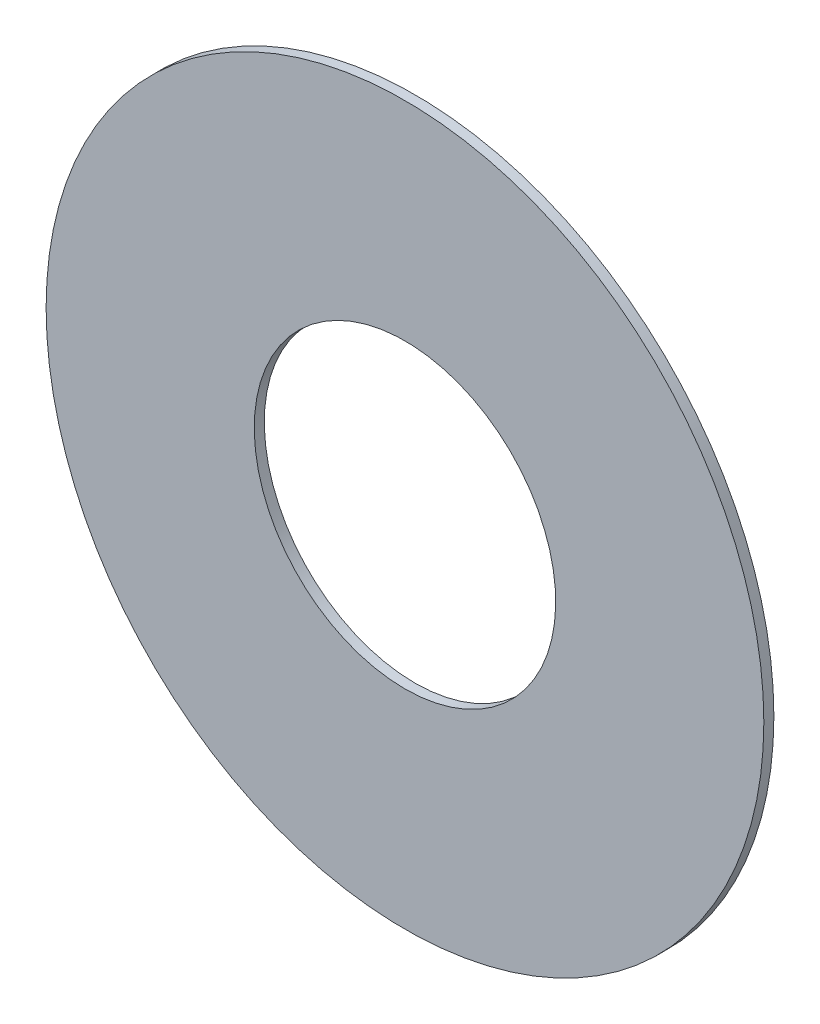
ISO-10303-21;
HEADER;
FILE_DESCRIPTION(('STEP AP214'),'2;1');
FILE_NAME('part.step','',(''),(''),'','','');
FILE_SCHEMA(('AUTOMOTIVE_DESIGN { 1 0 10303 214 1 1 1 1 }'));
ENDSEC;
DATA;
#1=APPLICATION_CONTEXT('core data for automotive mechanical design processes');
#2=APPLICATION_PROTOCOL_DEFINITION('international standard','automotive_design',2000,#1);
#3=PRODUCT_CONTEXT('',#1,'mechanical');
#4=PRODUCT('Part','Part','',(#3));
#5=PRODUCT_RELATED_PRODUCT_CATEGORY('part','',(#4));
#6=PRODUCT_DEFINITION_FORMATION('','',#4);
#7=PRODUCT_DEFINITION_CONTEXT('part definition',#1,'design');
#8=PRODUCT_DEFINITION('design','',#6,#7);
#9=PRODUCT_DEFINITION_SHAPE('','',#8);
#10=(LENGTH_UNIT() NAMED_UNIT(*) SI_UNIT(.MILLI.,.METRE.));
#11=(NAMED_UNIT(*) PLANE_ANGLE_UNIT() SI_UNIT($,.RADIAN.));
#12=(NAMED_UNIT(*) SI_UNIT($,.STERADIAN.) SOLID_ANGLE_UNIT());
#13=UNCERTAINTY_MEASURE_WITH_UNIT(LENGTH_MEASURE(1.E-05),#10,'distance_accuracy_value','');
#14=(GEOMETRIC_REPRESENTATION_CONTEXT(3) GLOBAL_UNCERTAINTY_ASSIGNED_CONTEXT((#13)) GLOBAL_UNIT_ASSIGNED_CONTEXT((#10,
#11,#12)) REPRESENTATION_CONTEXT('',''));
#15=CARTESIAN_POINT('',(0.,0.,0.));
#16=DIRECTION('',(0.,0.,1.));
#17=DIRECTION('',(1.,0.,0.));
#18=AXIS2_PLACEMENT_3D('',#15,#16,#17);
#19=CARTESIAN_POINT('',(123.952,-125.984,-0.045));
#20=DIRECTION('',(0.,0.,-1.));
#21=DIRECTION('',(0.,-1.,0.));
#22=AXIS2_PLACEMENT_3D('',#19,#20,#21);
#23=CYLINDRICAL_SURFACE('',#22,0.525);
#24=CARTESIAN_POINT('',(123.952,-125.984,-0.035));
#25=DIRECTION('',(0.,0.,-1.));
#26=DIRECTION('',(0.,-1.,0.));
#27=AXIS2_PLACEMENT_3D('',#24,#25,#26);
#28=CIRCLE('',#27,0.525);
#29=CARTESIAN_POINT('',(123.952,-126.509,-0.035));
#30=VERTEX_POINT('',#29);
#31=EDGE_CURVE('E25',#30,#30,#28,.T.);
#32=ORIENTED_EDGE('',*,*,#31,.T.);
#33=DIRECTION('',(0.,0.,1.));
#34=VECTOR('',#33,1.);
#35=CARTESIAN_POINT('',(123.952,-126.509,-0.045));
#36=LINE('',#35,#34);
#37=CARTESIAN_POINT('',(123.952,-126.509,0.));
#38=VERTEX_POINT('',#37);
#39=EDGE_CURVE('E11',#30,#38,#36,.T.);
#40=ORIENTED_EDGE('',*,*,#39,.T.);
#41=CARTESIAN_POINT('',(123.952,-125.984,0.));
#42=DIRECTION('',(0.,0.,-1.));
#43=DIRECTION('',(0.,-1.,0.));
#44=AXIS2_PLACEMENT_3D('',#41,#42,#43);
#45=CIRCLE('',#44,0.525);
#46=EDGE_CURVE('E68',#38,#38,#45,.T.);
#47=ORIENTED_EDGE('',*,*,#46,.F.);
#48=ORIENTED_EDGE('',*,*,#39,.F.);
#49=EDGE_LOOP('',(#32,#40,#47,#48));
#50=FACE_BOUND('',#49,.T.);
#51=ADVANCED_FACE('F17',(#50),#23,.F.);
#52=CARTESIAN_POINT('',(123.952,-125.984,-0.035));
#53=DIRECTION('',(0.,0.,1.));
#54=DIRECTION('',(1.,0.,0.));
#55=AXIS2_PLACEMENT_3D('',#52,#53,#54);
#56=PLANE('',#55);
#57=ORIENTED_EDGE('',*,*,#31,.F.);
#58=EDGE_LOOP('',(#57));
#59=FACE_BOUND('',#58,.T.);
#60=CARTESIAN_POINT('',(123.952,-125.984,-0.035));
#61=DIRECTION('',(0.,0.,1.));
#62=DIRECTION('',(1.,0.,0.));
#63=AXIS2_PLACEMENT_3D('',#60,#61,#62);
#64=CIRCLE('',#63,1.25);
#65=CARTESIAN_POINT('',(125.202,-125.984,-0.035));
#66=VERTEX_POINT('',#65);
#67=EDGE_CURVE('E56',#66,#66,#64,.T.);
#68=ORIENTED_EDGE('',*,*,#67,.F.);
#69=EDGE_LOOP('',(#68));
#70=FACE_BOUND('',#69,.T.);
#71=ADVANCED_FACE('F77',(#59,#70),#56,.F.);
#72=CARTESIAN_POINT('',(123.952,-125.984,0.));
#73=DIRECTION('',(0.,0.,1.));
#74=DIRECTION('',(1.,0.,0.));
#75=AXIS2_PLACEMENT_3D('',#72,#73,#74);
#76=PLANE('',#75);
#77=ORIENTED_EDGE('',*,*,#46,.T.);
#78=EDGE_LOOP('',(#77));
#79=FACE_BOUND('',#78,.T.);
#80=CARTESIAN_POINT('',(123.952,-125.984,0.));
#81=DIRECTION('',(0.,0.,1.));
#82=DIRECTION('',(1.,0.,0.));
#83=AXIS2_PLACEMENT_3D('',#80,#81,#82);
#84=CIRCLE('',#83,1.25);
#85=CARTESIAN_POINT('',(125.202,-125.984,0.));
#86=VERTEX_POINT('',#85);
#87=EDGE_CURVE('E54',#86,#86,#84,.T.);
#88=ORIENTED_EDGE('',*,*,#87,.T.);
#89=EDGE_LOOP('',(#88));
#90=FACE_BOUND('',#89,.T.);
#91=ADVANCED_FACE('F60',(#79,#90),#76,.T.);
#92=CARTESIAN_POINT('',(123.952,-125.984,-0.035));
#93=DIRECTION('',(0.,0.,1.));
#94=DIRECTION('',(1.,0.,0.));
#95=AXIS2_PLACEMENT_3D('',#92,#93,#94);
#96=CYLINDRICAL_SURFACE('',#95,1.25);
#97=ORIENTED_EDGE('',*,*,#87,.F.);
#98=DIRECTION('',(0.,0.,1.));
#99=VECTOR('',#98,1.);
#100=CARTESIAN_POINT('',(125.202,-125.984,-0.035));
#101=LINE('',#100,#99);
#102=EDGE_CURVE('E51',#66,#86,#101,.T.);
#103=ORIENTED_EDGE('',*,*,#102,.F.);
#104=ORIENTED_EDGE('',*,*,#67,.T.);
#105=ORIENTED_EDGE('',*,*,#102,.T.);
#106=EDGE_LOOP('',(#97,#103,#104,#105));
#107=FACE_BOUND('',#106,.T.);
#108=ADVANCED_FACE('F53',(#107),#96,.T.);
#109=CLOSED_SHELL('',(#51,#71,#91,#108));
#110=MANIFOLD_SOLID_BREP('B1',#109);
#111=ADVANCED_BREP_SHAPE_REPRESENTATION('',(#18,#110),#14);
#112=SHAPE_DEFINITION_REPRESENTATION(#9,#111);
ENDSEC;
END-ISO-10303-21;
